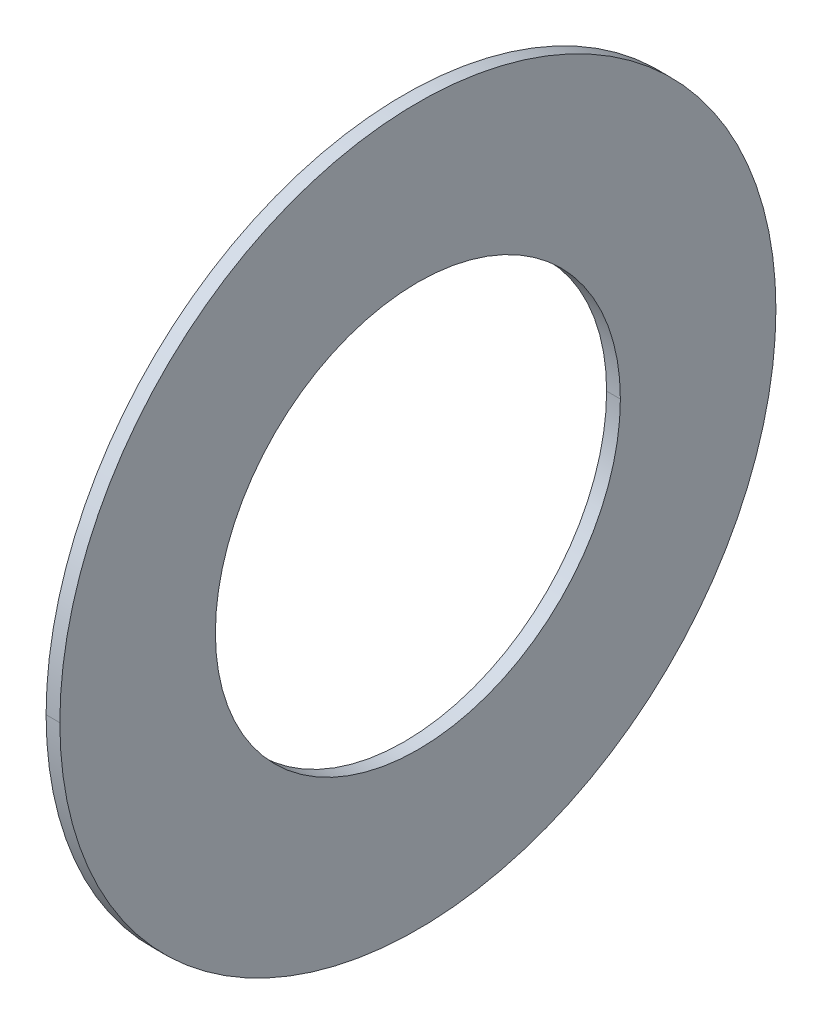
ISO-10303-21;
HEADER;
FILE_DESCRIPTION(('STEP AP214'),'2;1');
FILE_NAME('part.step','',(''),(''),'','','');
FILE_SCHEMA(('AUTOMOTIVE_DESIGN { 1 0 10303 214 1 1 1 1 }'));
ENDSEC;
DATA;
#1=APPLICATION_CONTEXT('core data for automotive mechanical design processes');
#2=APPLICATION_PROTOCOL_DEFINITION('international standard','automotive_design',2000,#1);
#3=PRODUCT_CONTEXT('',#1,'mechanical');
#4=PRODUCT('Part','Part','',(#3));
#5=PRODUCT_RELATED_PRODUCT_CATEGORY('part','',(#4));
#6=PRODUCT_DEFINITION_FORMATION('','',#4);
#7=PRODUCT_DEFINITION_CONTEXT('part definition',#1,'design');
#8=PRODUCT_DEFINITION('design','',#6,#7);
#9=PRODUCT_DEFINITION_SHAPE('','',#8);
#10=(LENGTH_UNIT() NAMED_UNIT(*) SI_UNIT(.MILLI.,.METRE.));
#11=(NAMED_UNIT(*) PLANE_ANGLE_UNIT() SI_UNIT($,.RADIAN.));
#12=(NAMED_UNIT(*) SI_UNIT($,.STERADIAN.) SOLID_ANGLE_UNIT());
#13=UNCERTAINTY_MEASURE_WITH_UNIT(LENGTH_MEASURE(1.E-05),#10,'distance_accuracy_value','');
#14=(GEOMETRIC_REPRESENTATION_CONTEXT(3) GLOBAL_UNCERTAINTY_ASSIGNED_CONTEXT((#13)) GLOBAL_UNIT_ASSIGNED_CONTEXT((#10,
#11,#12)) REPRESENTATION_CONTEXT('',''));
#15=CARTESIAN_POINT('',(0.,0.,0.));
#16=DIRECTION('',(0.,0.,1.));
#17=DIRECTION('',(1.,0.,0.));
#18=AXIS2_PLACEMENT_3D('',#15,#16,#17);
#19=CARTESIAN_POINT('',(0.3125,6.1,0.));
#20=DIRECTION('',(-1.,0.,0.));
#21=DIRECTION('',(0.,0.,1.));
#22=AXIS2_PLACEMENT_3D('',#19,#20,#21);
#23=PLANE('',#22);
#24=CARTESIAN_POINT('',(0.3125,0.,0.));
#25=DIRECTION('',(1.,0.,0.));
#26=DIRECTION('',(0.,0.,-1.));
#27=AXIS2_PLACEMENT_3D('',#24,#25,#26);
#28=CIRCLE('',#27,3.45);
#29=CARTESIAN_POINT('',(0.3125,0.,-3.45));
#30=VERTEX_POINT('',#29);
#31=CARTESIAN_POINT('',(0.3125,0.,3.45));
#32=VERTEX_POINT('',#31);
#33=EDGE_CURVE('E11',#30,#32,#28,.T.);
#34=ORIENTED_EDGE('',*,*,#33,.T.);
#35=CARTESIAN_POINT('',(0.3125,0.,0.));
#36=DIRECTION('',(1.,0.,0.));
#37=DIRECTION('',(0.,0.,-1.));
#38=AXIS2_PLACEMENT_3D('',#35,#36,#37);
#39=CIRCLE('',#38,3.45);
#40=EDGE_CURVE('E25',#32,#30,#39,.T.);
#41=ORIENTED_EDGE('',*,*,#40,.T.);
#42=EDGE_LOOP('',(#34,#41));
#43=FACE_BOUND('',#42,.T.);
#44=CARTESIAN_POINT('',(0.3125,0.,0.));
#45=DIRECTION('',(1.,0.,0.));
#46=DIRECTION('',(0.,0.,-1.));
#47=AXIS2_PLACEMENT_3D('',#44,#45,#46);
#48=CIRCLE('',#47,6.1);
#49=CARTESIAN_POINT('',(0.3125,0.,-6.1));
#50=VERTEX_POINT('',#49);
#51=CARTESIAN_POINT('',(0.3125,0.,6.1));
#52=VERTEX_POINT('',#51);
#53=EDGE_CURVE('E96',#50,#52,#48,.T.);
#54=ORIENTED_EDGE('',*,*,#53,.F.);
#55=CARTESIAN_POINT('',(0.3125,0.,0.));
#56=DIRECTION('',(1.,0.,0.));
#57=DIRECTION('',(0.,0.,-1.));
#58=AXIS2_PLACEMENT_3D('',#55,#56,#57);
#59=CIRCLE('',#58,6.1);
#60=EDGE_CURVE('E91',#52,#50,#59,.T.);
#61=ORIENTED_EDGE('',*,*,#60,.F.);
#62=EDGE_LOOP('',(#54,#61));
#63=FACE_BOUND('',#62,.T.);
#64=ADVANCED_FACE('F17',(#43,#63),#23,.T.);
#65=CARTESIAN_POINT('',(0.54675,0.,0.));
#66=DIRECTION('',(-1.,0.,0.));
#67=DIRECTION('',(0.,1.,0.));
#68=AXIS2_PLACEMENT_3D('',#65,#66,#67);
#69=CYLINDRICAL_SURFACE('',#68,6.1);
#70=ORIENTED_EDGE('',*,*,#60,.T.);
#71=DIRECTION('',(-1.,0.,0.));
#72=VECTOR('',#71,1.);
#73=CARTESIAN_POINT('',(0.54675,0.,-6.1));
#74=LINE('',#73,#72);
#75=CARTESIAN_POINT('',(0.54675,0.,-6.1));
#76=VERTEX_POINT('',#75);
#77=EDGE_CURVE('E86',#76,#50,#74,.T.);
#78=ORIENTED_EDGE('',*,*,#77,.F.);
#79=CARTESIAN_POINT('',(0.54675,0.,0.));
#80=DIRECTION('',(1.,0.,0.));
#81=DIRECTION('',(0.,0.,-1.));
#82=AXIS2_PLACEMENT_3D('',#79,#80,#81);
#83=CIRCLE('',#82,6.1);
#84=CARTESIAN_POINT('',(0.54675,0.,6.1));
#85=VERTEX_POINT('',#84);
#86=EDGE_CURVE('E81',#85,#76,#83,.T.);
#87=ORIENTED_EDGE('',*,*,#86,.F.);
#88=DIRECTION('',(-1.,0.,0.));
#89=VECTOR('',#88,1.);
#90=CARTESIAN_POINT('',(0.54675,0.,6.1));
#91=LINE('',#90,#89);
#92=EDGE_CURVE('E70',#85,#52,#91,.T.);
#93=ORIENTED_EDGE('',*,*,#92,.T.);
#94=EDGE_LOOP('',(#70,#78,#87,#93));
#95=FACE_BOUND('',#94,.T.);
#96=ADVANCED_FACE('F111',(#95),#69,.T.);
#97=CARTESIAN_POINT('',(0.54675,0.,0.));
#98=DIRECTION('',(-1.,0.,0.));
#99=DIRECTION('',(0.,-1.,0.));
#100=AXIS2_PLACEMENT_3D('',#97,#98,#99);
#101=CYLINDRICAL_SURFACE('',#100,6.1);
#102=CARTESIAN_POINT('',(0.54675,0.,0.));
#103=DIRECTION('',(1.,0.,0.));
#104=DIRECTION('',(0.,0.,-1.));
#105=AXIS2_PLACEMENT_3D('',#102,#103,#104);
#106=CIRCLE('',#105,6.1);
#107=EDGE_CURVE('E67',#76,#85,#106,.T.);
#108=ORIENTED_EDGE('',*,*,#107,.F.);
#109=ORIENTED_EDGE('',*,*,#77,.T.);
#110=ORIENTED_EDGE('',*,*,#53,.T.);
#111=ORIENTED_EDGE('',*,*,#92,.F.);
#112=EDGE_LOOP('',(#108,#109,#110,#111));
#113=FACE_BOUND('',#112,.T.);
#114=ADVANCED_FACE('F108',(#113),#101,.T.);
#115=CARTESIAN_POINT('',(0.54675,3.45,0.));
#116=DIRECTION('',(1.,0.,0.));
#117=DIRECTION('',(0.,0.,-1.));
#118=AXIS2_PLACEMENT_3D('',#115,#116,#117);
#119=PLANE('',#118);
#120=ORIENTED_EDGE('',*,*,#107,.T.);
#121=ORIENTED_EDGE('',*,*,#86,.T.);
#122=EDGE_LOOP('',(#120,#121));
#123=FACE_BOUND('',#122,.T.);
#124=CARTESIAN_POINT('',(0.54675,0.,0.));
#125=DIRECTION('',(1.,0.,0.));
#126=DIRECTION('',(0.,0.,-1.));
#127=AXIS2_PLACEMENT_3D('',#124,#125,#126);
#128=CIRCLE('',#127,3.45);
#129=CARTESIAN_POINT('',(0.54675,0.,-3.45));
#130=VERTEX_POINT('',#129);
#131=CARTESIAN_POINT('',(0.54675,0.,3.45));
#132=VERTEX_POINT('',#131);
#133=EDGE_CURVE('E56',#130,#132,#128,.T.);
#134=ORIENTED_EDGE('',*,*,#133,.F.);
#135=CARTESIAN_POINT('',(0.54675,0.,0.));
#136=DIRECTION('',(1.,0.,0.));
#137=DIRECTION('',(0.,0.,-1.));
#138=AXIS2_PLACEMENT_3D('',#135,#136,#137);
#139=CIRCLE('',#138,3.45);
#140=EDGE_CURVE('E52',#132,#130,#139,.T.);
#141=ORIENTED_EDGE('',*,*,#140,.F.);
#142=EDGE_LOOP('',(#134,#141));
#143=FACE_BOUND('',#142,.T.);
#144=ADVANCED_FACE('F54',(#123,#143),#119,.T.);
#145=CARTESIAN_POINT('',(0.54675,0.,0.));
#146=DIRECTION('',(-1.,0.,0.));
#147=DIRECTION('',(0.,1.,0.));
#148=AXIS2_PLACEMENT_3D('',#145,#146,#147);
#149=CYLINDRICAL_SURFACE('',#148,3.45);
#150=ORIENTED_EDGE('',*,*,#40,.F.);
#151=DIRECTION('',(-1.,0.,0.));
#152=VECTOR('',#151,1.);
#153=CARTESIAN_POINT('',(0.54675,0.,3.45));
#154=LINE('',#153,#152);
#155=EDGE_CURVE('E59',#132,#32,#154,.T.);
#156=ORIENTED_EDGE('',*,*,#155,.F.);
#157=ORIENTED_EDGE('',*,*,#140,.T.);
#158=DIRECTION('',(-1.,0.,0.));
#159=VECTOR('',#158,1.);
#160=CARTESIAN_POINT('',(0.54675,0.,-3.45));
#161=LINE('',#160,#159);
#162=EDGE_CURVE('E64',#130,#30,#161,.T.);
#163=ORIENTED_EDGE('',*,*,#162,.T.);
#164=EDGE_LOOP('',(#150,#156,#157,#163));
#165=FACE_BOUND('',#164,.T.);
#166=ADVANCED_FACE('F62',(#165),#149,.F.);
#167=CARTESIAN_POINT('',(0.54675,0.,0.));
#168=DIRECTION('',(-1.,0.,0.));
#169=DIRECTION('',(0.,-1.,0.));
#170=AXIS2_PLACEMENT_3D('',#167,#168,#169);
#171=CYLINDRICAL_SURFACE('',#170,3.45);
#172=ORIENTED_EDGE('',*,*,#133,.T.);
#173=ORIENTED_EDGE('',*,*,#155,.T.);
#174=ORIENTED_EDGE('',*,*,#33,.F.);
#175=ORIENTED_EDGE('',*,*,#162,.F.);
#176=EDGE_LOOP('',(#172,#173,#174,#175));
#177=FACE_BOUND('',#176,.T.);
#178=ADVANCED_FACE('F66',(#177),#171,.F.);
#179=CLOSED_SHELL('',(#64,#96,#114,#144,#166,#178));
#180=MANIFOLD_SOLID_BREP('B1',#179);
#181=ADVANCED_BREP_SHAPE_REPRESENTATION('',(#18,#180),#14);
#182=SHAPE_DEFINITION_REPRESENTATION(#9,#181);
ENDSEC;
END-ISO-10303-21;
